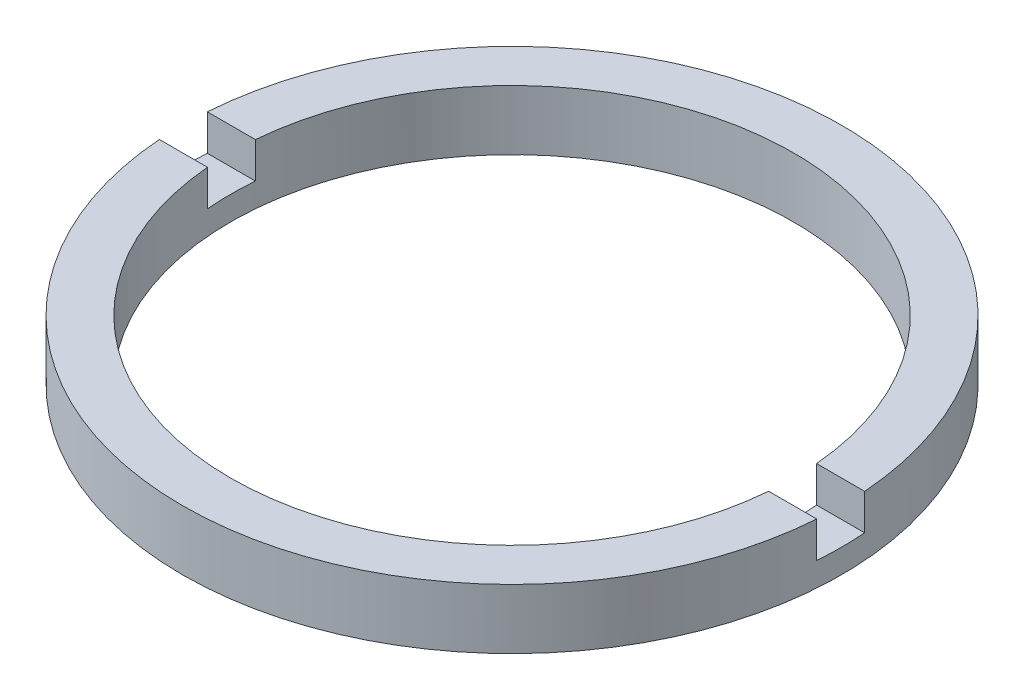
ISO-10303-21;
HEADER;
FILE_DESCRIPTION(('STEP AP214'),'2;1');
FILE_NAME('part.step','',(''),(''),'','','');
FILE_SCHEMA(('AUTOMOTIVE_DESIGN { 1 0 10303 214 1 1 1 1 }'));
ENDSEC;
DATA;
#1=APPLICATION_CONTEXT('core data for automotive mechanical design processes');
#2=APPLICATION_PROTOCOL_DEFINITION('international standard','automotive_design',2000,#1);
#3=PRODUCT_CONTEXT('',#1,'mechanical');
#4=PRODUCT('Part','Part','',(#3));
#5=PRODUCT_RELATED_PRODUCT_CATEGORY('part','',(#4));
#6=PRODUCT_DEFINITION_FORMATION('','',#4);
#7=PRODUCT_DEFINITION_CONTEXT('part definition',#1,'design');
#8=PRODUCT_DEFINITION('design','',#6,#7);
#9=PRODUCT_DEFINITION_SHAPE('','',#8);
#10=(LENGTH_UNIT() NAMED_UNIT(*) SI_UNIT(.MILLI.,.METRE.));
#11=(NAMED_UNIT(*) PLANE_ANGLE_UNIT() SI_UNIT($,.RADIAN.));
#12=(NAMED_UNIT(*) SI_UNIT($,.STERADIAN.) SOLID_ANGLE_UNIT());
#13=UNCERTAINTY_MEASURE_WITH_UNIT(LENGTH_MEASURE(1.E-05),#10,'distance_accuracy_value','');
#14=(GEOMETRIC_REPRESENTATION_CONTEXT(3) GLOBAL_UNCERTAINTY_ASSIGNED_CONTEXT((#13)) GLOBAL_UNIT_ASSIGNED_CONTEXT((#10,
#11,#12)) REPRESENTATION_CONTEXT('',''));
#15=CARTESIAN_POINT('',(0.,0.,0.));
#16=DIRECTION('',(0.,0.,1.));
#17=DIRECTION('',(1.,0.,0.));
#18=AXIS2_PLACEMENT_3D('',#15,#16,#17);
#19=CARTESIAN_POINT('',(11.75,-1.96424978717943,0.));
#20=DIRECTION('',(0.,-1.,0.));
#21=DIRECTION('',(0.,0.,-1.));
#22=AXIS2_PLACEMENT_3D('',#19,#20,#21);
#23=PLANE('',#22);
#24=CARTESIAN_POINT('',(0.,-1.96424978717943,0.));
#25=DIRECTION('',(0.,1.,0.));
#26=DIRECTION('',(0.,0.,1.));
#27=AXIS2_PLACEMENT_3D('',#24,#25,#26);
#28=CIRCLE('',#27,13.75);
#29=CARTESIAN_POINT('',(-13.7135881519025,-1.96424978717943,1.));
#30=VERTEX_POINT('',#29);
#31=CARTESIAN_POINT('',(13.7135881519025,-1.96424978717943,1.));
#32=VERTEX_POINT('',#31);
#33=EDGE_CURVE('E126',#30,#32,#28,.T.);
#34=ORIENTED_EDGE('',*,*,#33,.T.);
#35=DIRECTION('',(1.,0.,0.));
#36=VECTOR('',#35,1.);
#37=CARTESIAN_POINT('',(-26.8525402726146,-1.96424978717943,1.));
#38=LINE('',#37,#36);
#39=CARTESIAN_POINT('',(11.7073694739681,-1.96424978717943,1.));
#40=VERTEX_POINT('',#39);
#41=EDGE_CURVE('E119',#40,#32,#38,.T.);
#42=ORIENTED_EDGE('',*,*,#41,.F.);
#43=CARTESIAN_POINT('',(0.,-1.96424978717943,0.));
#44=DIRECTION('',(0.,1.,0.));
#45=DIRECTION('',(0.,0.,1.));
#46=AXIS2_PLACEMENT_3D('',#43,#44,#45);
#47=CIRCLE('',#46,11.75);
#48=CARTESIAN_POINT('',(-11.7073694739681,-1.96424978717943,1.));
#49=VERTEX_POINT('',#48);
#50=EDGE_CURVE('E133',#49,#40,#47,.T.);
#51=ORIENTED_EDGE('',*,*,#50,.F.);
#52=EDGE_CURVE('E148',#30,#49,#38,.T.);
#53=ORIENTED_EDGE('',*,*,#52,.F.);
#54=EDGE_LOOP('',(#34,#42,#51,#53));
#55=FACE_BOUND('',#54,.T.);
#56=ADVANCED_FACE('F36',(#55),#23,.F.);
#57=CARTESIAN_POINT('',(0.,56.2608426270136,0.));
#58=DIRECTION('',(0.,1.,0.));
#59=DIRECTION('',(0.,0.,1.));
#60=AXIS2_PLACEMENT_3D('',#57,#58,#59);
#61=CYLINDRICAL_SURFACE('',#60,13.75);
#62=CARTESIAN_POINT('',(0.,-3.46424978717943,0.));
#63=DIRECTION('',(0.,1.,0.));
#64=DIRECTION('',(0.,0.,1.));
#65=AXIS2_PLACEMENT_3D('',#62,#63,#64);
#66=CIRCLE('',#65,13.75);
#67=CARTESIAN_POINT('',(13.7135881519025,-3.46424978717943,1.));
#68=VERTEX_POINT('',#67);
#69=CARTESIAN_POINT('',(13.7135881519025,-3.46424978717943,-1.));
#70=VERTEX_POINT('',#69);
#71=EDGE_CURVE('E109',#68,#70,#66,.T.);
#72=ORIENTED_EDGE('',*,*,#71,.F.);
#73=DIRECTION('',(0.,1.,0.));
#74=VECTOR('',#73,1.);
#75=CARTESIAN_POINT('',(13.7135881519025,56.2608426270136,1.));
#76=LINE('',#75,#74);
#77=EDGE_CURVE('E161',#68,#32,#76,.T.);
#78=ORIENTED_EDGE('',*,*,#77,.T.);
#79=ORIENTED_EDGE('',*,*,#33,.F.);
#80=DIRECTION('',(0.,1.,0.));
#81=VECTOR('',#80,1.);
#82=CARTESIAN_POINT('',(-13.7135881519025,56.2608426270136,1.));
#83=LINE('',#82,#81);
#84=CARTESIAN_POINT('',(-13.7135881519025,-3.46424978717943,1.));
#85=VERTEX_POINT('',#84);
#86=EDGE_CURVE('E158',#30,#85,#83,.F.);
#87=ORIENTED_EDGE('',*,*,#86,.T.);
#88=CARTESIAN_POINT('',(-13.7135881519025,-3.46424978717943,-1.));
#89=VERTEX_POINT('',#88);
#90=EDGE_CURVE('E155',#89,#85,#66,.T.);
#91=ORIENTED_EDGE('',*,*,#90,.F.);
#92=DIRECTION('',(0.,1.,0.));
#93=VECTOR('',#92,1.);
#94=CARTESIAN_POINT('',(-13.7135881519025,56.2608426270136,-1.));
#95=LINE('',#94,#93);
#96=CARTESIAN_POINT('',(-13.7135881519025,-1.96424978717943,-1.));
#97=VERTEX_POINT('',#96);
#98=EDGE_CURVE('E108',#89,#97,#95,.T.);
#99=ORIENTED_EDGE('',*,*,#98,.T.);
#100=CARTESIAN_POINT('',(13.7135881519025,-1.96424978717943,-1.));
#101=VERTEX_POINT('',#100);
#102=EDGE_CURVE('E116',#101,#97,#28,.T.);
#103=ORIENTED_EDGE('',*,*,#102,.F.);
#104=DIRECTION('',(0.,1.,0.));
#105=VECTOR('',#104,1.);
#106=CARTESIAN_POINT('',(13.7135881519025,56.2608426270136,-1.));
#107=LINE('',#106,#105);
#108=EDGE_CURVE('E100',#101,#70,#107,.F.);
#109=ORIENTED_EDGE('',*,*,#108,.T.);
#110=EDGE_LOOP('',(#72,#78,#79,#87,#91,#99,#103,#109));
#111=FACE_BOUND('',#110,.T.);
#112=CARTESIAN_POINT('',(0.,-4.46424978717943,0.));
#113=DIRECTION('',(0.,1.,0.));
#114=DIRECTION('',(0.,0.,1.));
#115=AXIS2_PLACEMENT_3D('',#112,#113,#114);
#116=CIRCLE('',#115,13.75);
#117=CARTESIAN_POINT('',(0.,-4.46424978717943,13.75));
#118=VERTEX_POINT('',#117);
#119=EDGE_CURVE('E164',#118,#118,#116,.T.);
#120=ORIENTED_EDGE('',*,*,#119,.T.);
#121=EDGE_LOOP('',(#120));
#122=FACE_BOUND('',#121,.T.);
#123=ADVANCED_FACE('F38',(#111,#122),#61,.T.);
#124=ORIENTED_EDGE('',*,*,#102,.T.);
#125=DIRECTION('',(-1.,0.,0.));
#126=VECTOR('',#125,1.);
#127=CARTESIAN_POINT('',(-26.8525402726146,-1.96424978717943,-1.));
#128=LINE('',#127,#126);
#129=CARTESIAN_POINT('',(-11.7073694739681,-1.96424978717943,-1.));
#130=VERTEX_POINT('',#129);
#131=EDGE_CURVE('E120',#130,#97,#128,.T.);
#132=ORIENTED_EDGE('',*,*,#131,.F.);
#133=CARTESIAN_POINT('',(11.7073694739681,-1.96424978717943,-1.));
#134=VERTEX_POINT('',#133);
#135=EDGE_CURVE('E118',#134,#130,#47,.T.);
#136=ORIENTED_EDGE('',*,*,#135,.F.);
#137=EDGE_CURVE('E103',#101,#134,#128,.T.);
#138=ORIENTED_EDGE('',*,*,#137,.F.);
#139=EDGE_LOOP('',(#124,#132,#136,#138));
#140=FACE_BOUND('',#139,.T.);
#141=ADVANCED_FACE('F114',(#140),#23,.F.);
#142=CARTESIAN_POINT('',(0.,56.2608426270136,0.));
#143=DIRECTION('',(0.,1.,0.));
#144=DIRECTION('',(0.,0.,1.));
#145=AXIS2_PLACEMENT_3D('',#142,#143,#144);
#146=CYLINDRICAL_SURFACE('',#145,11.75);
#147=CARTESIAN_POINT('',(0.,-3.46424978717943,0.));
#148=DIRECTION('',(0.,1.,0.));
#149=DIRECTION('',(0.,0.,1.));
#150=AXIS2_PLACEMENT_3D('',#147,#148,#149);
#151=CIRCLE('',#150,11.75);
#152=CARTESIAN_POINT('',(-11.7073694739681,-3.46424978717943,1.));
#153=VERTEX_POINT('',#152);
#154=CARTESIAN_POINT('',(-11.7073694739681,-3.46424978717943,-1.));
#155=VERTEX_POINT('',#154);
#156=EDGE_CURVE('E130',#153,#155,#151,.F.);
#157=ORIENTED_EDGE('',*,*,#156,.F.);
#158=DIRECTION('',(0.,1.,0.));
#159=VECTOR('',#158,1.);
#160=CARTESIAN_POINT('',(-11.7073694739681,56.2608426270136,1.));
#161=LINE('',#160,#159);
#162=EDGE_CURVE('E11',#153,#49,#161,.T.);
#163=ORIENTED_EDGE('',*,*,#162,.T.);
#164=ORIENTED_EDGE('',*,*,#50,.T.);
#165=DIRECTION('',(0.,1.,0.));
#166=VECTOR('',#165,1.);
#167=CARTESIAN_POINT('',(11.7073694739681,56.2608426270136,1.));
#168=LINE('',#167,#166);
#169=CARTESIAN_POINT('',(11.7073694739681,-3.46424978717943,1.));
#170=VERTEX_POINT('',#169);
#171=EDGE_CURVE('E137',#40,#170,#168,.F.);
#172=ORIENTED_EDGE('',*,*,#171,.T.);
#173=CARTESIAN_POINT('',(11.7073694739681,-3.46424978717943,-1.));
#174=VERTEX_POINT('',#173);
#175=EDGE_CURVE('E125',#174,#170,#151,.F.);
#176=ORIENTED_EDGE('',*,*,#175,.F.);
#177=DIRECTION('',(0.,1.,0.));
#178=VECTOR('',#177,1.);
#179=CARTESIAN_POINT('',(11.7073694739681,56.2608426270136,-1.));
#180=LINE('',#179,#178);
#181=EDGE_CURVE('E128',#174,#134,#180,.T.);
#182=ORIENTED_EDGE('',*,*,#181,.T.);
#183=ORIENTED_EDGE('',*,*,#135,.T.);
#184=DIRECTION('',(0.,1.,0.));
#185=VECTOR('',#184,1.);
#186=CARTESIAN_POINT('',(-11.7073694739681,56.2608426270136,-1.));
#187=LINE('',#186,#185);
#188=EDGE_CURVE('E44',#130,#155,#187,.F.);
#189=ORIENTED_EDGE('',*,*,#188,.T.);
#190=EDGE_LOOP('',(#157,#163,#164,#172,#176,#182,#183,#189));
#191=FACE_BOUND('',#190,.T.);
#192=CARTESIAN_POINT('',(0.,-4.46424978717943,0.));
#193=DIRECTION('',(0.,1.,0.));
#194=DIRECTION('',(0.,0.,1.));
#195=AXIS2_PLACEMENT_3D('',#192,#193,#194);
#196=CIRCLE('',#195,11.75);
#197=CARTESIAN_POINT('',(0.,-4.46424978717943,11.75));
#198=VERTEX_POINT('',#197);
#199=EDGE_CURVE('E166',#198,#198,#196,.T.);
#200=ORIENTED_EDGE('',*,*,#199,.F.);
#201=EDGE_LOOP('',(#200));
#202=FACE_BOUND('',#201,.T.);
#203=ADVANCED_FACE('F172',(#191,#202),#146,.F.);
#204=CARTESIAN_POINT('',(11.75,-4.46424978717943,0.));
#205=DIRECTION('',(0.,1.,0.));
#206=DIRECTION('',(0.,0.,1.));
#207=AXIS2_PLACEMENT_3D('',#204,#205,#206);
#208=PLANE('',#207);
#209=ORIENTED_EDGE('',*,*,#119,.F.);
#210=EDGE_LOOP('',(#209));
#211=FACE_BOUND('',#210,.T.);
#212=ORIENTED_EDGE('',*,*,#199,.T.);
#213=EDGE_LOOP('',(#212));
#214=FACE_BOUND('',#213,.T.);
#215=ADVANCED_FACE('F202',(#211,#214),#208,.F.);
#216=CARTESIAN_POINT('',(0.,-3.46424978717943,0.));
#217=DIRECTION('',(0.,1.,0.));
#218=DIRECTION('',(0.,0.,1.));
#219=AXIS2_PLACEMENT_3D('',#216,#217,#218);
#220=PLANE('',#219);
#221=ORIENTED_EDGE('',*,*,#71,.T.);
#222=DIRECTION('',(-1.,0.,0.));
#223=VECTOR('',#222,1.);
#224=CARTESIAN_POINT('',(-26.8525402726146,-3.46424978717943,-1.));
#225=LINE('',#224,#223);
#226=EDGE_CURVE('E59',#70,#174,#225,.T.);
#227=ORIENTED_EDGE('',*,*,#226,.T.);
#228=ORIENTED_EDGE('',*,*,#175,.T.);
#229=DIRECTION('',(1.,0.,0.));
#230=VECTOR('',#229,1.);
#231=CARTESIAN_POINT('',(-26.8525402726146,-3.46424978717943,1.));
#232=LINE('',#231,#230);
#233=EDGE_CURVE('E150',#170,#68,#232,.T.);
#234=ORIENTED_EDGE('',*,*,#233,.T.);
#235=EDGE_LOOP('',(#221,#227,#228,#234));
#236=FACE_BOUND('',#235,.T.);
#237=ADVANCED_FACE('F176',(#236),#220,.T.);
#238=CARTESIAN_POINT('',(-26.8525402726146,-3.46424978717943,-1.));
#239=DIRECTION('',(0.,0.,-1.));
#240=DIRECTION('',(-1.,0.,0.));
#241=AXIS2_PLACEMENT_3D('',#238,#239,#240);
#242=PLANE('',#241);
#243=ORIENTED_EDGE('',*,*,#137,.T.);
#244=ORIENTED_EDGE('',*,*,#181,.F.);
#245=ORIENTED_EDGE('',*,*,#226,.F.);
#246=ORIENTED_EDGE('',*,*,#108,.F.);
#247=EDGE_LOOP('',(#243,#244,#245,#246));
#248=FACE_BOUND('',#247,.T.);
#249=ADVANCED_FACE('F102',(#248),#242,.F.);
#250=CARTESIAN_POINT('',(-26.8525402726146,-3.46424978717943,1.));
#251=DIRECTION('',(0.,0.,1.));
#252=DIRECTION('',(1.,0.,0.));
#253=AXIS2_PLACEMENT_3D('',#250,#251,#252);
#254=PLANE('',#253);
#255=ORIENTED_EDGE('',*,*,#233,.F.);
#256=ORIENTED_EDGE('',*,*,#171,.F.);
#257=ORIENTED_EDGE('',*,*,#41,.T.);
#258=ORIENTED_EDGE('',*,*,#77,.F.);
#259=EDGE_LOOP('',(#255,#256,#257,#258));
#260=FACE_BOUND('',#259,.T.);
#261=ADVANCED_FACE('F178',(#260),#254,.F.);
#262=ORIENTED_EDGE('',*,*,#52,.T.);
#263=ORIENTED_EDGE('',*,*,#162,.F.);
#264=EDGE_CURVE('E51',#85,#153,#232,.T.);
#265=ORIENTED_EDGE('',*,*,#264,.F.);
#266=ORIENTED_EDGE('',*,*,#86,.F.);
#267=EDGE_LOOP('',(#262,#263,#265,#266));
#268=FACE_BOUND('',#267,.T.);
#269=ADVANCED_FACE('F184',(#268),#254,.F.);
#270=EDGE_CURVE('E145',#155,#89,#225,.T.);
#271=ORIENTED_EDGE('',*,*,#270,.F.);
#272=ORIENTED_EDGE('',*,*,#188,.F.);
#273=ORIENTED_EDGE('',*,*,#131,.T.);
#274=ORIENTED_EDGE('',*,*,#98,.F.);
#275=EDGE_LOOP('',(#271,#272,#273,#274));
#276=FACE_BOUND('',#275,.T.);
#277=ADVANCED_FACE('F147',(#276),#242,.F.);
#278=ORIENTED_EDGE('',*,*,#90,.T.);
#279=ORIENTED_EDGE('',*,*,#264,.T.);
#280=ORIENTED_EDGE('',*,*,#156,.T.);
#281=ORIENTED_EDGE('',*,*,#270,.T.);
#282=EDGE_LOOP('',(#278,#279,#280,#281));
#283=FACE_BOUND('',#282,.T.);
#284=ADVANCED_FACE('F144',(#283),#220,.T.);
#285=CLOSED_SHELL('',(#56,#123,#141,#203,#215,#237,#249,#261,#269,#277,#284));
#286=MANIFOLD_SOLID_BREP('B2',#285);
#287=ADVANCED_BREP_SHAPE_REPRESENTATION('',(#18,#286),#14);
#288=SHAPE_DEFINITION_REPRESENTATION(#9,#287);
ENDSEC;
END-ISO-10303-21;
